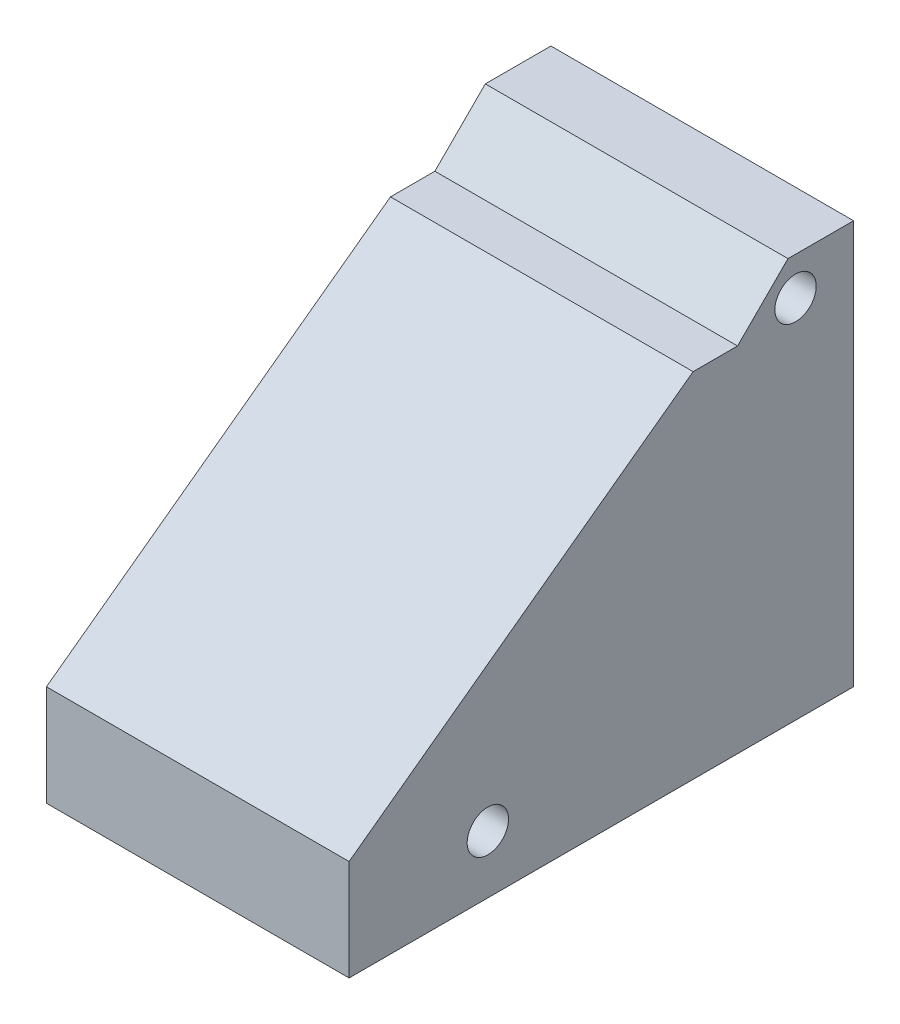
ISO-10303-21;
HEADER;
FILE_DESCRIPTION(('STEP AP214'),'2;1');
FILE_NAME('part.step','',(''),(''),'','','');
FILE_SCHEMA(('AUTOMOTIVE_DESIGN { 1 0 10303 214 1 1 1 1 }'));
ENDSEC;
DATA;
#1=APPLICATION_CONTEXT('core data for automotive mechanical design processes');
#2=APPLICATION_PROTOCOL_DEFINITION('international standard','automotive_design',2000,#1);
#3=PRODUCT_CONTEXT('',#1,'mechanical');
#4=PRODUCT('Part','Part','',(#3));
#5=PRODUCT_RELATED_PRODUCT_CATEGORY('part','',(#4));
#6=PRODUCT_DEFINITION_FORMATION('','',#4);
#7=PRODUCT_DEFINITION_CONTEXT('part definition',#1,'design');
#8=PRODUCT_DEFINITION('design','',#6,#7);
#9=PRODUCT_DEFINITION_SHAPE('','',#8);
#10=(LENGTH_UNIT() NAMED_UNIT(*) SI_UNIT(.MILLI.,.METRE.));
#11=(NAMED_UNIT(*) PLANE_ANGLE_UNIT() SI_UNIT($,.RADIAN.));
#12=(NAMED_UNIT(*) SI_UNIT($,.STERADIAN.) SOLID_ANGLE_UNIT());
#13=UNCERTAINTY_MEASURE_WITH_UNIT(LENGTH_MEASURE(1.E-05),#10,'distance_accuracy_value','');
#14=(GEOMETRIC_REPRESENTATION_CONTEXT(3) GLOBAL_UNCERTAINTY_ASSIGNED_CONTEXT((#13)) GLOBAL_UNIT_ASSIGNED_CONTEXT((#10,
#11,#12)) REPRESENTATION_CONTEXT('',''));
#15=CARTESIAN_POINT('',(0.,0.,0.));
#16=DIRECTION('',(0.,0.,1.));
#17=DIRECTION('',(1.,0.,0.));
#18=AXIS2_PLACEMENT_3D('',#15,#16,#17);
#19=CARTESIAN_POINT('',(60.,0.,0.));
#20=DIRECTION('',(-1.,0.,0.));
#21=DIRECTION('',(0.,0.,1.));
#22=AXIS2_PLACEMENT_3D('',#19,#20,#21);
#23=PLANE('',#22);
#24=DIRECTION('',(0.,1.,0.));
#25=VECTOR('',#24,1.);
#26=CARTESIAN_POINT('',(60.,80.,0.));
#27=LINE('',#26,#25);
#28=CARTESIAN_POINT('',(60.,0.,0.));
#29=VERTEX_POINT('',#28);
#30=CARTESIAN_POINT('',(60.,80.,0.));
#31=VERTEX_POINT('',#30);
#32=EDGE_CURVE('E139',#29,#31,#27,.T.);
#33=ORIENTED_EDGE('',*,*,#32,.T.);
#34=DIRECTION('',(0.,0.,1.));
#35=VECTOR('',#34,1.);
#36=CARTESIAN_POINT('',(60.,80.,13.));
#37=LINE('',#36,#35);
#38=CARTESIAN_POINT('',(60.,80.,13.));
#39=VERTEX_POINT('',#38);
#40=EDGE_CURVE('E92',#31,#39,#37,.T.);
#41=ORIENTED_EDGE('',*,*,#40,.T.);
#42=DIRECTION('',(0.,-0.707106781186544,0.707106781186551));
#43=VECTOR('',#42,1.);
#44=CARTESIAN_POINT('',(60.,70.0015101140223,22.9984898859778));
#45=LINE('',#44,#43);
#46=CARTESIAN_POINT('',(60.,70.0015101140223,22.9984898859778));
#47=VERTEX_POINT('',#46);
#48=EDGE_CURVE('E151',#39,#47,#45,.T.);
#49=ORIENTED_EDGE('',*,*,#48,.T.);
#50=DIRECTION('',(0.,0.,1.));
#51=VECTOR('',#50,1.);
#52=CARTESIAN_POINT('',(60.,70.0015101140223,31.805308067796));
#53=LINE('',#52,#51);
#54=CARTESIAN_POINT('',(60.,70.0015101140223,31.805308067796));
#55=VERTEX_POINT('',#54);
#56=EDGE_CURVE('E108',#47,#55,#53,.T.);
#57=ORIENTED_EDGE('',*,*,#56,.T.);
#58=DIRECTION('',(0.,-0.591302674388266,0.806449717751382));
#59=VECTOR('',#58,1.);
#60=CARTESIAN_POINT('',(60.,20.,100.));
#61=LINE('',#60,#59);
#62=CARTESIAN_POINT('',(60.,20.,100.));
#63=VERTEX_POINT('',#62);
#64=EDGE_CURVE('E102',#55,#63,#61,.T.);
#65=ORIENTED_EDGE('',*,*,#64,.T.);
#66=DIRECTION('',(0.,-1.,0.));
#67=VECTOR('',#66,1.);
#68=CARTESIAN_POINT('',(60.,0.,100.));
#69=LINE('',#68,#67);
#70=CARTESIAN_POINT('',(60.,0.,100.));
#71=VERTEX_POINT('',#70);
#72=EDGE_CURVE('E106',#63,#71,#69,.T.);
#73=ORIENTED_EDGE('',*,*,#72,.T.);
#74=DIRECTION('',(0.,0.,-1.));
#75=VECTOR('',#74,1.);
#76=CARTESIAN_POINT('',(60.,0.,0.));
#77=LINE('',#76,#75);
#78=EDGE_CURVE('E52',#71,#29,#77,.T.);
#79=ORIENTED_EDGE('',*,*,#78,.T.);
#80=EDGE_LOOP('',(#33,#41,#49,#57,#65,#73,#79));
#81=FACE_BOUND('',#80,.T.);
#82=CARTESIAN_POINT('',(60.,72.5,11.5));
#83=DIRECTION('',(1.,0.,0.));
#84=DIRECTION('',(0.,0.,-1.));
#85=AXIS2_PLACEMENT_3D('',#82,#83,#84);
#86=CIRCLE('',#85,4.1);
#87=CARTESIAN_POINT('',(60.,72.5,7.39999999999999));
#88=VERTEX_POINT('',#87);
#89=EDGE_CURVE('E130',#88,#88,#86,.T.);
#90=ORIENTED_EDGE('',*,*,#89,.F.);
#91=EDGE_LOOP('',(#90));
#92=FACE_BOUND('',#91,.T.);
#93=CARTESIAN_POINT('',(60.,11.5,72.5));
#94=DIRECTION('',(1.,0.,0.));
#95=DIRECTION('',(0.,0.,-1.));
#96=AXIS2_PLACEMENT_3D('',#93,#94,#95);
#97=CIRCLE('',#96,4.09999999999999);
#98=CARTESIAN_POINT('',(60.,11.5,68.4));
#99=VERTEX_POINT('',#98);
#100=EDGE_CURVE('E166',#99,#99,#97,.T.);
#101=ORIENTED_EDGE('',*,*,#100,.F.);
#102=EDGE_LOOP('',(#101));
#103=FACE_BOUND('',#102,.T.);
#104=ADVANCED_FACE('F35',(#81,#92,#103),#23,.F.);
#105=CARTESIAN_POINT('',(0.,0.,0.));
#106=DIRECTION('',(-1.,0.,0.));
#107=DIRECTION('',(0.,0.,1.));
#108=AXIS2_PLACEMENT_3D('',#105,#106,#107);
#109=PLANE('',#108);
#110=CARTESIAN_POINT('',(0.,72.5,11.5));
#111=DIRECTION('',(1.,0.,0.));
#112=DIRECTION('',(0.,0.,-1.));
#113=AXIS2_PLACEMENT_3D('',#110,#111,#112);
#114=CIRCLE('',#113,4.1);
#115=CARTESIAN_POINT('',(0.,72.5,7.39999999999999));
#116=VERTEX_POINT('',#115);
#117=EDGE_CURVE('E163',#116,#116,#114,.T.);
#118=ORIENTED_EDGE('',*,*,#117,.T.);
#119=EDGE_LOOP('',(#118));
#120=FACE_BOUND('',#119,.T.);
#121=DIRECTION('',(0.,1.,0.));
#122=VECTOR('',#121,1.);
#123=CARTESIAN_POINT('',(0.,80.,0.));
#124=LINE('',#123,#122);
#125=CARTESIAN_POINT('',(0.,0.,0.));
#126=VERTEX_POINT('',#125);
#127=CARTESIAN_POINT('',(0.,80.,0.));
#128=VERTEX_POINT('',#127);
#129=EDGE_CURVE('E126',#126,#128,#124,.T.);
#130=ORIENTED_EDGE('',*,*,#129,.F.);
#131=DIRECTION('',(0.,0.,-1.));
#132=VECTOR('',#131,1.);
#133=CARTESIAN_POINT('',(0.,0.,0.));
#134=LINE('',#133,#132);
#135=CARTESIAN_POINT('',(0.,0.,100.));
#136=VERTEX_POINT('',#135);
#137=EDGE_CURVE('E84',#136,#126,#134,.T.);
#138=ORIENTED_EDGE('',*,*,#137,.F.);
#139=DIRECTION('',(0.,-1.,0.));
#140=VECTOR('',#139,1.);
#141=CARTESIAN_POINT('',(0.,0.,100.));
#142=LINE('',#141,#140);
#143=CARTESIAN_POINT('',(0.,20.,100.));
#144=VERTEX_POINT('',#143);
#145=EDGE_CURVE('E78',#144,#136,#142,.T.);
#146=ORIENTED_EDGE('',*,*,#145,.F.);
#147=DIRECTION('',(0.,-0.591302674388266,0.806449717751382));
#148=VECTOR('',#147,1.);
#149=CARTESIAN_POINT('',(0.,20.,100.));
#150=LINE('',#149,#148);
#151=CARTESIAN_POINT('',(0.,70.0015101140223,31.805308067796));
#152=VERTEX_POINT('',#151);
#153=EDGE_CURVE('E116',#152,#144,#150,.T.);
#154=ORIENTED_EDGE('',*,*,#153,.F.);
#155=DIRECTION('',(0.,0.,1.));
#156=VECTOR('',#155,1.);
#157=CARTESIAN_POINT('',(0.,70.0015101140223,31.805308067796));
#158=LINE('',#157,#156);
#159=CARTESIAN_POINT('',(0.,70.0015101140223,22.9984898859778));
#160=VERTEX_POINT('',#159);
#161=EDGE_CURVE('E134',#160,#152,#158,.T.);
#162=ORIENTED_EDGE('',*,*,#161,.F.);
#163=DIRECTION('',(0.,-0.707106781186544,0.707106781186551));
#164=VECTOR('',#163,1.);
#165=CARTESIAN_POINT('',(0.,70.0015101140223,22.9984898859778));
#166=LINE('',#165,#164);
#167=CARTESIAN_POINT('',(0.,80.,13.));
#168=VERTEX_POINT('',#167);
#169=EDGE_CURVE('E132',#168,#160,#166,.T.);
#170=ORIENTED_EDGE('',*,*,#169,.F.);
#171=DIRECTION('',(0.,0.,1.));
#172=VECTOR('',#171,1.);
#173=CARTESIAN_POINT('',(0.,80.,13.));
#174=LINE('',#173,#172);
#175=EDGE_CURVE('E129',#128,#168,#174,.T.);
#176=ORIENTED_EDGE('',*,*,#175,.F.);
#177=EDGE_LOOP('',(#130,#138,#146,#154,#162,#170,#176));
#178=FACE_BOUND('',#177,.T.);
#179=CARTESIAN_POINT('',(0.,11.5,72.5));
#180=DIRECTION('',(1.,0.,0.));
#181=DIRECTION('',(0.,0.,-1.));
#182=AXIS2_PLACEMENT_3D('',#179,#180,#181);
#183=CIRCLE('',#182,4.09999999999999);
#184=CARTESIAN_POINT('',(0.,11.5,68.4));
#185=VERTEX_POINT('',#184);
#186=EDGE_CURVE('E169',#185,#185,#183,.T.);
#187=ORIENTED_EDGE('',*,*,#186,.T.);
#188=EDGE_LOOP('',(#187));
#189=FACE_BOUND('',#188,.T.);
#190=ADVANCED_FACE('F155',(#120,#178,#189),#109,.T.);
#191=CARTESIAN_POINT('',(60.,80.,0.));
#192=DIRECTION('',(0.,0.,1.));
#193=DIRECTION('',(0.,-1.,0.));
#194=AXIS2_PLACEMENT_3D('',#191,#192,#193);
#195=PLANE('',#194);
#196=ORIENTED_EDGE('',*,*,#129,.T.);
#197=DIRECTION('',(-1.,0.,0.));
#198=VECTOR('',#197,1.);
#199=CARTESIAN_POINT('',(60.,80.,0.));
#200=LINE('',#199,#198);
#201=EDGE_CURVE('E11',#31,#128,#200,.T.);
#202=ORIENTED_EDGE('',*,*,#201,.F.);
#203=ORIENTED_EDGE('',*,*,#32,.F.);
#204=DIRECTION('',(-1.,0.,0.));
#205=VECTOR('',#204,1.);
#206=CARTESIAN_POINT('',(60.,0.,0.));
#207=LINE('',#206,#205);
#208=EDGE_CURVE('E122',#29,#126,#207,.T.);
#209=ORIENTED_EDGE('',*,*,#208,.T.);
#210=EDGE_LOOP('',(#196,#202,#203,#209));
#211=FACE_BOUND('',#210,.T.);
#212=ADVANCED_FACE('F37',(#211),#195,.F.);
#213=CARTESIAN_POINT('',(60.,80.,13.));
#214=DIRECTION('',(0.,-1.,0.));
#215=DIRECTION('',(0.,0.,-1.));
#216=AXIS2_PLACEMENT_3D('',#213,#214,#215);
#217=PLANE('',#216);
#218=ORIENTED_EDGE('',*,*,#175,.T.);
#219=DIRECTION('',(-1.,0.,0.));
#220=VECTOR('',#219,1.);
#221=CARTESIAN_POINT('',(60.,80.,13.));
#222=LINE('',#221,#220);
#223=EDGE_CURVE('E44',#39,#168,#222,.T.);
#224=ORIENTED_EDGE('',*,*,#223,.F.);
#225=ORIENTED_EDGE('',*,*,#40,.F.);
#226=ORIENTED_EDGE('',*,*,#201,.T.);
#227=EDGE_LOOP('',(#218,#224,#225,#226));
#228=FACE_BOUND('',#227,.T.);
#229=ADVANCED_FACE('F199',(#228),#217,.F.);
#230=CARTESIAN_POINT('',(60.,70.0015101140223,22.9984898859778));
#231=DIRECTION('',(0.,-0.707106781186551,-0.707106781186544));
#232=DIRECTION('',(0.,0.707106781186544,-0.707106781186551));
#233=AXIS2_PLACEMENT_3D('',#230,#231,#232);
#234=PLANE('',#233);
#235=ORIENTED_EDGE('',*,*,#169,.T.);
#236=DIRECTION('',(-1.,0.,0.));
#237=VECTOR('',#236,1.);
#238=CARTESIAN_POINT('',(60.,70.0015101140223,22.9984898859778));
#239=LINE('',#238,#237);
#240=EDGE_CURVE('E143',#47,#160,#239,.T.);
#241=ORIENTED_EDGE('',*,*,#240,.F.);
#242=ORIENTED_EDGE('',*,*,#48,.F.);
#243=ORIENTED_EDGE('',*,*,#223,.T.);
#244=EDGE_LOOP('',(#235,#241,#242,#243));
#245=FACE_BOUND('',#244,.T.);
#246=ADVANCED_FACE('F149',(#245),#234,.F.);
#247=CARTESIAN_POINT('',(60.,70.0015101140223,31.805308067796));
#248=DIRECTION('',(0.,-1.,0.));
#249=DIRECTION('',(0.,0.,-1.));
#250=AXIS2_PLACEMENT_3D('',#247,#248,#249);
#251=PLANE('',#250);
#252=ORIENTED_EDGE('',*,*,#161,.T.);
#253=DIRECTION('',(-1.,0.,0.));
#254=VECTOR('',#253,1.);
#255=CARTESIAN_POINT('',(60.,70.0015101140223,31.805308067796));
#256=LINE('',#255,#254);
#257=EDGE_CURVE('E117',#55,#152,#256,.T.);
#258=ORIENTED_EDGE('',*,*,#257,.F.);
#259=ORIENTED_EDGE('',*,*,#56,.F.);
#260=ORIENTED_EDGE('',*,*,#240,.T.);
#261=EDGE_LOOP('',(#252,#258,#259,#260));
#262=FACE_BOUND('',#261,.T.);
#263=ADVANCED_FACE('F158',(#262),#251,.F.);
#264=CARTESIAN_POINT('',(60.,20.,100.));
#265=DIRECTION('',(0.,-0.806449717751382,-0.591302674388266));
#266=DIRECTION('',(0.,0.591302674388266,-0.806449717751382));
#267=AXIS2_PLACEMENT_3D('',#264,#265,#266);
#268=PLANE('',#267);
#269=ORIENTED_EDGE('',*,*,#153,.T.);
#270=DIRECTION('',(-1.,0.,0.));
#271=VECTOR('',#270,1.);
#272=CARTESIAN_POINT('',(60.,20.,100.));
#273=LINE('',#272,#271);
#274=EDGE_CURVE('E113',#63,#144,#273,.T.);
#275=ORIENTED_EDGE('',*,*,#274,.F.);
#276=ORIENTED_EDGE('',*,*,#64,.F.);
#277=ORIENTED_EDGE('',*,*,#257,.T.);
#278=EDGE_LOOP('',(#269,#275,#276,#277));
#279=FACE_BOUND('',#278,.T.);
#280=ADVANCED_FACE('F114',(#279),#268,.F.);
#281=CARTESIAN_POINT('',(60.,0.,100.));
#282=DIRECTION('',(0.,0.,-1.));
#283=DIRECTION('',(-1.,0.,0.));
#284=AXIS2_PLACEMENT_3D('',#281,#282,#283);
#285=PLANE('',#284);
#286=ORIENTED_EDGE('',*,*,#145,.T.);
#287=DIRECTION('',(-1.,0.,0.));
#288=VECTOR('',#287,1.);
#289=CARTESIAN_POINT('',(60.,0.,100.));
#290=LINE('',#289,#288);
#291=EDGE_CURVE('E118',#71,#136,#290,.T.);
#292=ORIENTED_EDGE('',*,*,#291,.F.);
#293=ORIENTED_EDGE('',*,*,#72,.F.);
#294=ORIENTED_EDGE('',*,*,#274,.T.);
#295=EDGE_LOOP('',(#286,#292,#293,#294));
#296=FACE_BOUND('',#295,.T.);
#297=ADVANCED_FACE('F120',(#296),#285,.F.);
#298=CARTESIAN_POINT('',(60.,0.,0.));
#299=DIRECTION('',(0.,1.,0.));
#300=DIRECTION('',(0.,0.,1.));
#301=AXIS2_PLACEMENT_3D('',#298,#299,#300);
#302=PLANE('',#301);
#303=ORIENTED_EDGE('',*,*,#137,.T.);
#304=ORIENTED_EDGE('',*,*,#208,.F.);
#305=ORIENTED_EDGE('',*,*,#78,.F.);
#306=ORIENTED_EDGE('',*,*,#291,.T.);
#307=EDGE_LOOP('',(#303,#304,#305,#306));
#308=FACE_BOUND('',#307,.T.);
#309=ADVANCED_FACE('F189',(#308),#302,.F.);
#310=CARTESIAN_POINT('',(60.,72.5,11.5));
#311=DIRECTION('',(-1.,0.,0.));
#312=DIRECTION('',(0.,0.,1.));
#313=AXIS2_PLACEMENT_3D('',#310,#311,#312);
#314=CYLINDRICAL_SURFACE('',#313,4.1);
#315=ORIENTED_EDGE('',*,*,#89,.T.);
#316=EDGE_LOOP('',(#315));
#317=FACE_BOUND('',#316,.T.);
#318=ORIENTED_EDGE('',*,*,#117,.F.);
#319=EDGE_LOOP('',(#318));
#320=FACE_BOUND('',#319,.T.);
#321=ADVANCED_FACE('F186',(#317,#320),#314,.F.);
#322=CARTESIAN_POINT('',(60.,11.5,72.5));
#323=DIRECTION('',(-1.,0.,0.));
#324=DIRECTION('',(0.,0.,1.));
#325=AXIS2_PLACEMENT_3D('',#322,#323,#324);
#326=CYLINDRICAL_SURFACE('',#325,4.09999999999999);
#327=ORIENTED_EDGE('',*,*,#100,.T.);
#328=EDGE_LOOP('',(#327));
#329=FACE_BOUND('',#328,.T.);
#330=ORIENTED_EDGE('',*,*,#186,.F.);
#331=EDGE_LOOP('',(#330));
#332=FACE_BOUND('',#331,.T.);
#333=ADVANCED_FACE('F175',(#329,#332),#326,.F.);
#334=CLOSED_SHELL('',(#104,#190,#212,#229,#246,#263,#280,#297,#309,#321,#333));
#335=MANIFOLD_SOLID_BREP('B2',#334);
#336=ADVANCED_BREP_SHAPE_REPRESENTATION('',(#18,#335),#14);
#337=SHAPE_DEFINITION_REPRESENTATION(#9,#336);
ENDSEC;
END-ISO-10303-21;
